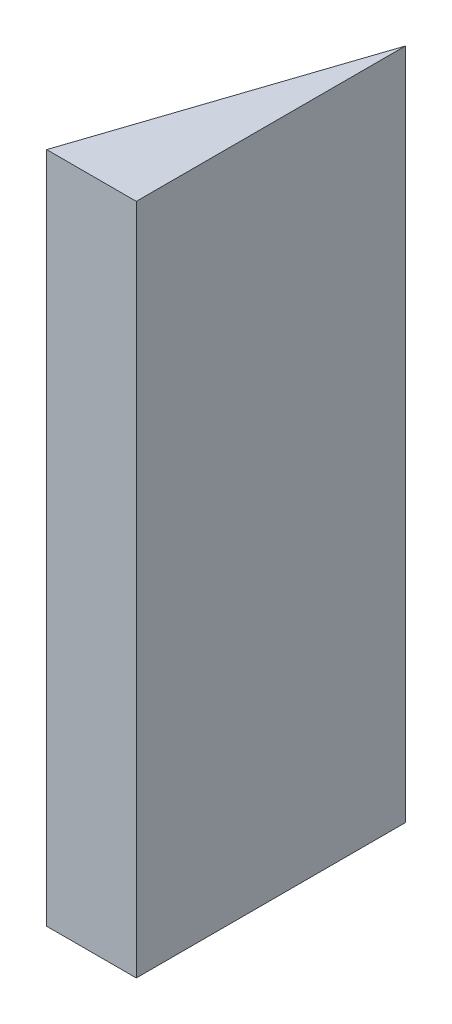
ISO-10303-21;
HEADER;
FILE_DESCRIPTION(('STEP AP214'),'2;1');
FILE_NAME('part.step','',(''),(''),'','','');
FILE_SCHEMA(('AUTOMOTIVE_DESIGN { 1 0 10303 214 1 1 1 1 }'));
ENDSEC;
DATA;
#1=APPLICATION_CONTEXT('core data for automotive mechanical design processes');
#2=APPLICATION_PROTOCOL_DEFINITION('international standard','automotive_design',2000,#1);
#3=PRODUCT_CONTEXT('',#1,'mechanical');
#4=PRODUCT('Part','Part','',(#3));
#5=PRODUCT_RELATED_PRODUCT_CATEGORY('part','',(#4));
#6=PRODUCT_DEFINITION_FORMATION('','',#4);
#7=PRODUCT_DEFINITION_CONTEXT('part definition',#1,'design');
#8=PRODUCT_DEFINITION('design','',#6,#7);
#9=PRODUCT_DEFINITION_SHAPE('','',#8);
#10=(LENGTH_UNIT() NAMED_UNIT(*) SI_UNIT(.MILLI.,.METRE.));
#11=(NAMED_UNIT(*) PLANE_ANGLE_UNIT() SI_UNIT($,.RADIAN.));
#12=(NAMED_UNIT(*) SI_UNIT($,.STERADIAN.) SOLID_ANGLE_UNIT());
#13=UNCERTAINTY_MEASURE_WITH_UNIT(LENGTH_MEASURE(1.E-05),#10,'distance_accuracy_value','');
#14=(GEOMETRIC_REPRESENTATION_CONTEXT(3) GLOBAL_UNCERTAINTY_ASSIGNED_CONTEXT((#13)) GLOBAL_UNIT_ASSIGNED_CONTEXT((#10,
#11,#12)) REPRESENTATION_CONTEXT('',''));
#15=CARTESIAN_POINT('',(0.,0.,0.));
#16=DIRECTION('',(0.,0.,1.));
#17=DIRECTION('',(1.,0.,0.));
#18=AXIS2_PLACEMENT_3D('',#15,#16,#17);
#19=CARTESIAN_POINT('',(3.92000030597969,1.74999913276506,-3.67112136800623));
#20=DIRECTION('',(1.74845553146952E-07,1.,8.74227765734759E-08));
#21=DIRECTION('',(-1.,1.74845553146952E-07,0.));
#22=AXIS2_PLACEMENT_3D('',#19,#20,#21);
#23=PLANE('',#22);
#24=DIRECTION('',(-0.315990463967219,-2.76939124899912E-08,0.948762365759615));
#25=VECTOR('',#24,1.);
#26=CARTESIAN_POINT('',(3.90000030597969,1.74999913451351,-3.65112136800623));
#27=LINE('',#26,#25);
#28=CARTESIAN_POINT('',(3.90000030597969,1.74999913451251,-3.65112136800623));
#29=VERTEX_POINT('',#28);
#30=CARTESIAN_POINT('',(3.76677813133568,1.74999912283671,-3.25112136800623));
#31=VERTEX_POINT('',#30);
#32=EDGE_CURVE('E11',#29,#31,#27,.T.);
#33=ORIENTED_EDGE('',*,*,#32,.T.);
#34=DIRECTION('',(0.999999999999985,-1.74845553322982E-07,0.));
#35=VECTOR('',#34,1.);
#36=CARTESIAN_POINT('',(3.76677813133568,1.74999912283771,-3.25112136800623));
#37=LINE('',#36,#35);
#38=CARTESIAN_POINT('',(3.90000030597968,1.7499990995434,-3.25112136800623));
#39=VERTEX_POINT('',#38);
#40=EDGE_CURVE('E49',#31,#39,#37,.T.);
#41=ORIENTED_EDGE('',*,*,#40,.T.);
#42=DIRECTION('',(0.,8.74227762404085E-08,-0.999999999999996));
#43=VECTOR('',#42,1.);
#44=CARTESIAN_POINT('',(3.90000030597968,1.7499990995444,-3.25112136800623));
#45=LINE('',#44,#43);
#46=EDGE_CURVE('E47',#39,#29,#45,.T.);
#47=ORIENTED_EDGE('',*,*,#46,.T.);
#48=EDGE_LOOP('',(#33,#41,#47));
#49=FACE_BOUND('',#48,.T.);
#50=ADVANCED_FACE('F17',(#49),#23,.T.);
#51=CARTESIAN_POINT('',(3.92000013113413,0.749999132765057,-3.67112145542901));
#52=DIRECTION('',(1.74845553146952E-07,1.,8.74227765734759E-08));
#53=DIRECTION('',(-1.,1.74845553146952E-07,0.));
#54=AXIS2_PLACEMENT_3D('',#51,#52,#53);
#55=PLANE('',#54);
#56=DIRECTION('',(0.,8.74227767955201E-08,-0.999999999999996));
#57=VECTOR('',#56,1.);
#58=CARTESIAN_POINT('',(3.90000013113413,0.749999099544401,-3.25112145542901));
#59=LINE('',#58,#57);
#60=CARTESIAN_POINT('',(3.90000013113413,0.749999099545401,-3.25112145542901));
#61=VERTEX_POINT('',#60);
#62=CARTESIAN_POINT('',(3.90000013113413,0.749999134514512,-3.65112145542901));
#63=VERTEX_POINT('',#62);
#64=EDGE_CURVE('E24',#61,#63,#59,.T.);
#65=ORIENTED_EDGE('',*,*,#64,.F.);
#66=DIRECTION('',(0.999999999999985,-1.74845553322981E-07,0.));
#67=VECTOR('',#66,1.);
#68=CARTESIAN_POINT('',(3.76677795649013,0.749999122837706,-3.25112145542901));
#69=LINE('',#68,#67);
#70=CARTESIAN_POINT('',(3.76677795649013,0.749999122838706,-3.25112145542901));
#71=VERTEX_POINT('',#70);
#72=EDGE_CURVE('E53',#71,#61,#69,.T.);
#73=ORIENTED_EDGE('',*,*,#72,.F.);
#74=DIRECTION('',(-0.31599046396722,-2.76939130166601E-08,0.948762365759614));
#75=VECTOR('',#74,1.);
#76=CARTESIAN_POINT('',(3.90000013113413,0.749999134513512,-3.65112145542901));
#77=LINE('',#76,#75);
#78=EDGE_CURVE('E68',#63,#71,#77,.T.);
#79=ORIENTED_EDGE('',*,*,#78,.F.);
#80=EDGE_LOOP('',(#65,#73,#79));
#81=FACE_BOUND('',#80,.T.);
#82=ADVANCED_FACE('F73',(#81),#55,.F.);
#83=CARTESIAN_POINT('',(3.90000030597969,1.74999913451351,-3.65112136800623));
#84=DIRECTION('',(0.948762365759614,-1.93511644403339E-07,0.315990463967207));
#85=DIRECTION('',(-0.315990463967221,-2.76939128616174E-08,0.948762365759619));
#86=AXIS2_PLACEMENT_3D('',#83,#84,#85);
#87=PLANE('',#86);
#88=DIRECTION('',(-1.74845553146948E-07,-0.999999999999981,-8.74227765734742E-08));
#89=VECTOR('',#88,1.);
#90=CARTESIAN_POINT('',(3.90000030597969,1.74999913451351,-3.65112136800624));
#91=LINE('',#90,#89);
#92=EDGE_CURVE('E59',#29,#63,#91,.T.);
#93=ORIENTED_EDGE('',*,*,#92,.T.);
#94=ORIENTED_EDGE('',*,*,#78,.T.);
#95=DIRECTION('',(-1.74845553146948E-07,-0.999999999999981,-8.74227765734742E-08));
#96=VECTOR('',#95,1.);
#97=CARTESIAN_POINT('',(3.76677813133568,1.74999912283771,-3.25112136800623));
#98=LINE('',#97,#96);
#99=EDGE_CURVE('E54',#31,#71,#98,.T.);
#100=ORIENTED_EDGE('',*,*,#99,.F.);
#101=ORIENTED_EDGE('',*,*,#32,.F.);
#102=EDGE_LOOP('',(#93,#94,#100,#101));
#103=FACE_BOUND('',#102,.T.);
#104=ADVANCED_FACE('F57',(#103),#87,.F.);
#105=CARTESIAN_POINT('',(3.76677813133568,1.74999912283771,-3.25112136800623));
#106=DIRECTION('',(0.,8.74227765734759E-08,-1.));
#107=DIRECTION('',(1.,-1.74845553146952E-07,0.));
#108=AXIS2_PLACEMENT_3D('',#105,#106,#107);
#109=PLANE('',#108);
#110=ORIENTED_EDGE('',*,*,#99,.T.);
#111=ORIENTED_EDGE('',*,*,#72,.T.);
#112=DIRECTION('',(-1.74845553146948E-07,-0.999999999999981,-8.74227765734742E-08));
#113=VECTOR('',#112,1.);
#114=CARTESIAN_POINT('',(3.90000030597968,1.7499990995444,-3.25112136800623));
#115=LINE('',#114,#113);
#116=EDGE_CURVE('E70',#39,#61,#115,.T.);
#117=ORIENTED_EDGE('',*,*,#116,.F.);
#118=ORIENTED_EDGE('',*,*,#40,.F.);
#119=EDGE_LOOP('',(#110,#111,#117,#118));
#120=FACE_BOUND('',#119,.T.);
#121=ADVANCED_FACE('F72',(#120),#109,.F.);
#122=CARTESIAN_POINT('',(3.90000030597968,1.7499990995444,-3.25112136800623));
#123=DIRECTION('',(-1.,1.74845553146952E-07,0.));
#124=DIRECTION('',(0.,8.74227765734759E-08,-1.));
#125=AXIS2_PLACEMENT_3D('',#122,#123,#124);
#126=PLANE('',#125);
#127=ORIENTED_EDGE('',*,*,#116,.T.);
#128=ORIENTED_EDGE('',*,*,#64,.T.);
#129=ORIENTED_EDGE('',*,*,#92,.F.);
#130=ORIENTED_EDGE('',*,*,#46,.F.);
#131=EDGE_LOOP('',(#127,#128,#129,#130));
#132=FACE_BOUND('',#131,.T.);
#133=ADVANCED_FACE('F61',(#132),#126,.F.);
#134=CLOSED_SHELL('',(#50,#82,#104,#121,#133));
#135=MANIFOLD_SOLID_BREP('B1',#134);
#136=ADVANCED_BREP_SHAPE_REPRESENTATION('',(#18,#135),#14);
#137=SHAPE_DEFINITION_REPRESENTATION(#9,#136);
ENDSEC;
END-ISO-10303-21;
